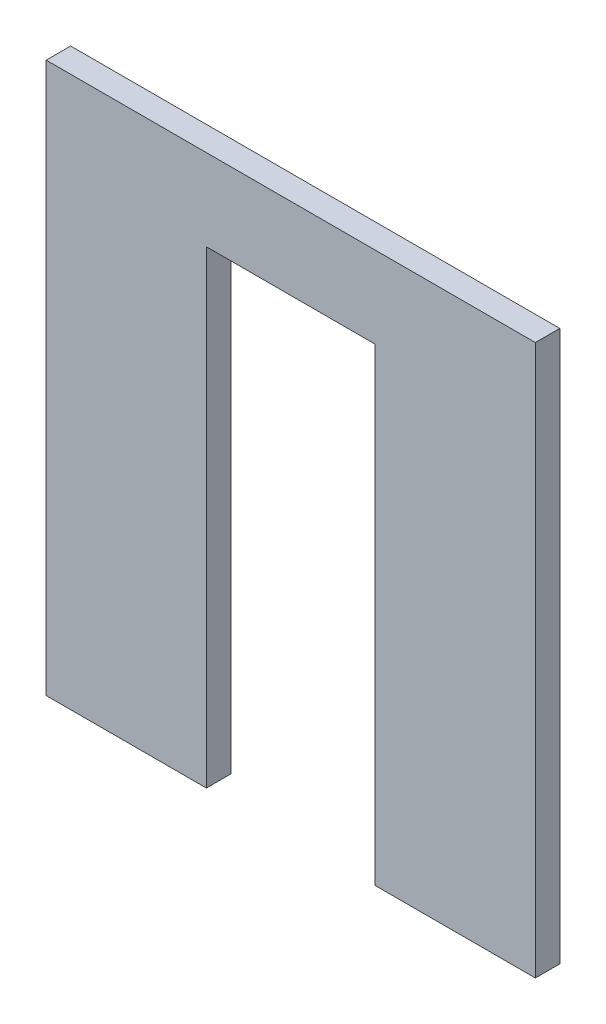
ISO-10303-21;
HEADER;
FILE_DESCRIPTION(('STEP AP214'),'2;1');
FILE_NAME('part.step','',(''),(''),'','','');
FILE_SCHEMA(('AUTOMOTIVE_DESIGN { 1 0 10303 214 1 1 1 1 }'));
ENDSEC;
DATA;
#1=APPLICATION_CONTEXT('core data for automotive mechanical design processes');
#2=APPLICATION_PROTOCOL_DEFINITION('international standard','automotive_design',2000,#1);
#3=PRODUCT_CONTEXT('',#1,'mechanical');
#4=PRODUCT('Part','Part','',(#3));
#5=PRODUCT_RELATED_PRODUCT_CATEGORY('part','',(#4));
#6=PRODUCT_DEFINITION_FORMATION('','',#4);
#7=PRODUCT_DEFINITION_CONTEXT('part definition',#1,'design');
#8=PRODUCT_DEFINITION('design','',#6,#7);
#9=PRODUCT_DEFINITION_SHAPE('','',#8);
#10=(LENGTH_UNIT() NAMED_UNIT(*) SI_UNIT(.MILLI.,.METRE.));
#11=(NAMED_UNIT(*) PLANE_ANGLE_UNIT() SI_UNIT($,.RADIAN.));
#12=(NAMED_UNIT(*) SI_UNIT($,.STERADIAN.) SOLID_ANGLE_UNIT());
#13=UNCERTAINTY_MEASURE_WITH_UNIT(LENGTH_MEASURE(1.E-05),#10,'distance_accuracy_value','');
#14=(GEOMETRIC_REPRESENTATION_CONTEXT(3) GLOBAL_UNCERTAINTY_ASSIGNED_CONTEXT((#13)) GLOBAL_UNIT_ASSIGNED_CONTEXT((#10,
#11,#12)) REPRESENTATION_CONTEXT('',''));
#15=CARTESIAN_POINT('',(0.,0.,0.));
#16=DIRECTION('',(0.,0.,1.));
#17=DIRECTION('',(1.,0.,0.));
#18=AXIS2_PLACEMENT_3D('',#15,#16,#17);
#19=CARTESIAN_POINT('',(0.,0.,0.003));
#20=DIRECTION('',(0.,1.,0.));
#21=DIRECTION('',(0.,0.,1.));
#22=AXIS2_PLACEMENT_3D('',#19,#20,#21);
#23=PLANE('',#22);
#24=DIRECTION('',(1.,0.,0.));
#25=VECTOR('',#24,1.);
#26=CARTESIAN_POINT('',(0.,0.,0.));
#27=LINE('',#26,#25);
#28=CARTESIAN_POINT('',(0.,0.,0.));
#29=VERTEX_POINT('',#28);
#30=CARTESIAN_POINT('',(0.01965,0.,0.));
#31=VERTEX_POINT('',#30);
#32=EDGE_CURVE('E135',#29,#31,#27,.T.);
#33=ORIENTED_EDGE('',*,*,#32,.T.);
#34=DIRECTION('',(0.,0.,-1.));
#35=VECTOR('',#34,1.);
#36=CARTESIAN_POINT('',(0.01965,0.,0.003));
#37=LINE('',#36,#35);
#38=CARTESIAN_POINT('',(0.01965,0.,0.003));
#39=VERTEX_POINT('',#38);
#40=EDGE_CURVE('E43',#39,#31,#37,.T.);
#41=ORIENTED_EDGE('',*,*,#40,.F.);
#42=DIRECTION('',(1.,0.,0.));
#43=VECTOR('',#42,1.);
#44=CARTESIAN_POINT('',(0.,0.,0.003));
#45=LINE('',#44,#43);
#46=CARTESIAN_POINT('',(0.,0.,0.003));
#47=VERTEX_POINT('',#46);
#48=EDGE_CURVE('E94',#47,#39,#45,.T.);
#49=ORIENTED_EDGE('',*,*,#48,.F.);
#50=DIRECTION('',(0.,0.,-1.));
#51=VECTOR('',#50,1.);
#52=CARTESIAN_POINT('',(0.,0.,0.003));
#53=LINE('',#52,#51);
#54=EDGE_CURVE('E11',#47,#29,#53,.T.);
#55=ORIENTED_EDGE('',*,*,#54,.T.);
#56=EDGE_LOOP('',(#33,#41,#49,#55));
#57=FACE_BOUND('',#56,.T.);
#58=ADVANCED_FACE('F35',(#57),#23,.F.);
#59=CARTESIAN_POINT('',(0.01965,0.,0.003));
#60=DIRECTION('',(-1.,0.,0.));
#61=DIRECTION('',(0.,0.,1.));
#62=AXIS2_PLACEMENT_3D('',#59,#60,#61);
#63=PLANE('',#62);
#64=DIRECTION('',(0.,1.,0.));
#65=VECTOR('',#64,1.);
#66=CARTESIAN_POINT('',(0.01965,0.,0.));
#67=LINE('',#66,#65);
#68=CARTESIAN_POINT('',(0.01965,0.0575,0.));
#69=VERTEX_POINT('',#68);
#70=EDGE_CURVE('E137',#31,#69,#67,.T.);
#71=ORIENTED_EDGE('',*,*,#70,.T.);
#72=DIRECTION('',(0.,0.,-1.));
#73=VECTOR('',#72,1.);
#74=CARTESIAN_POINT('',(0.01965,0.0575,0.003));
#75=LINE('',#74,#73);
#76=CARTESIAN_POINT('',(0.01965,0.0575,0.003));
#77=VERTEX_POINT('',#76);
#78=EDGE_CURVE('E154',#77,#69,#75,.T.);
#79=ORIENTED_EDGE('',*,*,#78,.F.);
#80=DIRECTION('',(0.,1.,0.));
#81=VECTOR('',#80,1.);
#82=CARTESIAN_POINT('',(0.01965,0.,0.003));
#83=LINE('',#82,#81);
#84=EDGE_CURVE('E162',#39,#77,#83,.T.);
#85=ORIENTED_EDGE('',*,*,#84,.F.);
#86=ORIENTED_EDGE('',*,*,#40,.T.);
#87=EDGE_LOOP('',(#71,#79,#85,#86));
#88=FACE_BOUND('',#87,.T.);
#89=ADVANCED_FACE('F160',(#88),#63,.F.);
#90=CARTESIAN_POINT('',(0.01965,0.0575,0.003));
#91=DIRECTION('',(0.,1.,0.));
#92=DIRECTION('',(0.,0.,1.));
#93=AXIS2_PLACEMENT_3D('',#90,#91,#92);
#94=PLANE('',#93);
#95=DIRECTION('',(1.,0.,0.));
#96=VECTOR('',#95,1.);
#97=CARTESIAN_POINT('',(0.01965,0.0575,0.));
#98=LINE('',#97,#96);
#99=CARTESIAN_POINT('',(0.04035,0.0575,0.));
#100=VERTEX_POINT('',#99);
#101=EDGE_CURVE('E139',#69,#100,#98,.T.);
#102=ORIENTED_EDGE('',*,*,#101,.T.);
#103=DIRECTION('',(0.,0.,-1.));
#104=VECTOR('',#103,1.);
#105=CARTESIAN_POINT('',(0.04035,0.0575,0.003));
#106=LINE('',#105,#104);
#107=CARTESIAN_POINT('',(0.04035,0.0575,0.003));
#108=VERTEX_POINT('',#107);
#109=EDGE_CURVE('E151',#108,#100,#106,.T.);
#110=ORIENTED_EDGE('',*,*,#109,.F.);
#111=DIRECTION('',(1.,0.,0.));
#112=VECTOR('',#111,1.);
#113=CARTESIAN_POINT('',(0.01965,0.0575,0.003));
#114=LINE('',#113,#112);
#115=EDGE_CURVE('E175',#77,#108,#114,.T.);
#116=ORIENTED_EDGE('',*,*,#115,.F.);
#117=ORIENTED_EDGE('',*,*,#78,.T.);
#118=EDGE_LOOP('',(#102,#110,#116,#117));
#119=FACE_BOUND('',#118,.T.);
#120=ADVANCED_FACE('F171',(#119),#94,.F.);
#121=CARTESIAN_POINT('',(0.04035,0.0575,0.003));
#122=DIRECTION('',(1.,0.,0.));
#123=DIRECTION('',(0.,1.,0.));
#124=AXIS2_PLACEMENT_3D('',#121,#122,#123);
#125=PLANE('',#124);
#126=DIRECTION('',(0.,-1.,0.));
#127=VECTOR('',#126,1.);
#128=CARTESIAN_POINT('',(0.04035,0.0575,0.));
#129=LINE('',#128,#127);
#130=CARTESIAN_POINT('',(0.04035,0.,0.));
#131=VERTEX_POINT('',#130);
#132=EDGE_CURVE('E141',#100,#131,#129,.T.);
#133=ORIENTED_EDGE('',*,*,#132,.T.);
#134=DIRECTION('',(0.,0.,-1.));
#135=VECTOR('',#134,1.);
#136=CARTESIAN_POINT('',(0.04035,0.,0.003));
#137=LINE('',#136,#135);
#138=CARTESIAN_POINT('',(0.04035,0.,0.003));
#139=VERTEX_POINT('',#138);
#140=EDGE_CURVE('E124',#139,#131,#137,.T.);
#141=ORIENTED_EDGE('',*,*,#140,.F.);
#142=DIRECTION('',(0.,-1.,0.));
#143=VECTOR('',#142,1.);
#144=CARTESIAN_POINT('',(0.04035,0.0575,0.003));
#145=LINE('',#144,#143);
#146=EDGE_CURVE('E114',#108,#139,#145,.T.);
#147=ORIENTED_EDGE('',*,*,#146,.F.);
#148=ORIENTED_EDGE('',*,*,#109,.T.);
#149=EDGE_LOOP('',(#133,#141,#147,#148));
#150=FACE_BOUND('',#149,.T.);
#151=ADVANCED_FACE('F174',(#150),#125,.F.);
#152=CARTESIAN_POINT('',(0.06,0.,0.003));
#153=DIRECTION('',(0.,1.,0.));
#154=DIRECTION('',(-1.,0.,0.));
#155=AXIS2_PLACEMENT_3D('',#152,#153,#154);
#156=PLANE('',#155);
#157=DIRECTION('',(1.,0.,0.));
#158=VECTOR('',#157,1.);
#159=CARTESIAN_POINT('',(0.06,0.,0.));
#160=LINE('',#159,#158);
#161=CARTESIAN_POINT('',(0.06,0.,0.));
#162=VERTEX_POINT('',#161);
#163=EDGE_CURVE('E123',#131,#162,#160,.T.);
#164=ORIENTED_EDGE('',*,*,#163,.T.);
#165=DIRECTION('',(0.,0.,-1.));
#166=VECTOR('',#165,1.);
#167=CARTESIAN_POINT('',(0.06,0.,0.003));
#168=LINE('',#167,#166);
#169=CARTESIAN_POINT('',(0.06,0.,0.003));
#170=VERTEX_POINT('',#169);
#171=EDGE_CURVE('E120',#170,#162,#168,.T.);
#172=ORIENTED_EDGE('',*,*,#171,.F.);
#173=DIRECTION('',(1.,0.,0.));
#174=VECTOR('',#173,1.);
#175=CARTESIAN_POINT('',(0.06,0.,0.003));
#176=LINE('',#175,#174);
#177=EDGE_CURVE('E108',#139,#170,#176,.T.);
#178=ORIENTED_EDGE('',*,*,#177,.F.);
#179=ORIENTED_EDGE('',*,*,#140,.T.);
#180=EDGE_LOOP('',(#164,#172,#178,#179));
#181=FACE_BOUND('',#180,.T.);
#182=ADVANCED_FACE('F121',(#181),#156,.F.);
#183=CARTESIAN_POINT('',(0.06,0.055,0.003));
#184=DIRECTION('',(-1.,0.,0.));
#185=DIRECTION('',(0.,0.,1.));
#186=AXIS2_PLACEMENT_3D('',#183,#184,#185);
#187=PLANE('',#186);
#188=DIRECTION('',(0.,1.,0.));
#189=VECTOR('',#188,1.);
#190=CARTESIAN_POINT('',(0.06,0.055,0.));
#191=LINE('',#190,#189);
#192=CARTESIAN_POINT('',(0.06,0.0675,0.));
#193=VERTEX_POINT('',#192);
#194=EDGE_CURVE('E80',#162,#193,#191,.T.);
#195=ORIENTED_EDGE('',*,*,#194,.T.);
#196=DIRECTION('',(0.,0.,-1.));
#197=VECTOR('',#196,1.);
#198=CARTESIAN_POINT('',(0.06,0.0675,0.003));
#199=LINE('',#198,#197);
#200=CARTESIAN_POINT('',(0.06,0.0675,0.003));
#201=VERTEX_POINT('',#200);
#202=EDGE_CURVE('E125',#201,#193,#199,.T.);
#203=ORIENTED_EDGE('',*,*,#202,.F.);
#204=DIRECTION('',(0.,1.,0.));
#205=VECTOR('',#204,1.);
#206=CARTESIAN_POINT('',(0.06,0.055,0.003));
#207=LINE('',#206,#205);
#208=EDGE_CURVE('E112',#170,#201,#207,.T.);
#209=ORIENTED_EDGE('',*,*,#208,.F.);
#210=ORIENTED_EDGE('',*,*,#171,.T.);
#211=EDGE_LOOP('',(#195,#203,#209,#210));
#212=FACE_BOUND('',#211,.T.);
#213=ADVANCED_FACE('F127',(#212),#187,.F.);
#214=CARTESIAN_POINT('',(0.,0.0675,0.003));
#215=DIRECTION('',(0.,-1.,0.));
#216=DIRECTION('',(0.,0.,-1.));
#217=AXIS2_PLACEMENT_3D('',#214,#215,#216);
#218=PLANE('',#217);
#219=DIRECTION('',(-1.,0.,0.));
#220=VECTOR('',#219,1.);
#221=CARTESIAN_POINT('',(0.,0.0675,0.));
#222=LINE('',#221,#220);
#223=CARTESIAN_POINT('',(0.,0.0675,0.));
#224=VERTEX_POINT('',#223);
#225=EDGE_CURVE('E87',#193,#224,#222,.T.);
#226=ORIENTED_EDGE('',*,*,#225,.T.);
#227=DIRECTION('',(0.,0.,-1.));
#228=VECTOR('',#227,1.);
#229=CARTESIAN_POINT('',(0.,0.0675,0.003));
#230=LINE('',#229,#228);
#231=CARTESIAN_POINT('',(0.,0.0675,0.003));
#232=VERTEX_POINT('',#231);
#233=EDGE_CURVE('E131',#232,#224,#230,.T.);
#234=ORIENTED_EDGE('',*,*,#233,.F.);
#235=DIRECTION('',(-1.,0.,0.));
#236=VECTOR('',#235,1.);
#237=CARTESIAN_POINT('',(0.,0.0675,0.003));
#238=LINE('',#237,#236);
#239=EDGE_CURVE('E129',#201,#232,#238,.T.);
#240=ORIENTED_EDGE('',*,*,#239,.F.);
#241=ORIENTED_EDGE('',*,*,#202,.T.);
#242=EDGE_LOOP('',(#226,#234,#240,#241));
#243=FACE_BOUND('',#242,.T.);
#244=ADVANCED_FACE('F196',(#243),#218,.F.);
#245=CARTESIAN_POINT('',(0.,0.055,0.003));
#246=DIRECTION('',(1.,0.,0.));
#247=DIRECTION('',(0.,0.,-1.));
#248=AXIS2_PLACEMENT_3D('',#245,#246,#247);
#249=PLANE('',#248);
#250=DIRECTION('',(0.,-1.,0.));
#251=VECTOR('',#250,1.);
#252=CARTESIAN_POINT('',(0.,0.055,0.));
#253=LINE('',#252,#251);
#254=EDGE_CURVE('E146',#224,#29,#253,.T.);
#255=ORIENTED_EDGE('',*,*,#254,.T.);
#256=ORIENTED_EDGE('',*,*,#54,.F.);
#257=DIRECTION('',(0.,-1.,0.));
#258=VECTOR('',#257,1.);
#259=CARTESIAN_POINT('',(0.,0.,0.003));
#260=LINE('',#259,#258);
#261=EDGE_CURVE('E51',#232,#47,#260,.T.);
#262=ORIENTED_EDGE('',*,*,#261,.F.);
#263=ORIENTED_EDGE('',*,*,#233,.T.);
#264=EDGE_LOOP('',(#255,#256,#262,#263));
#265=FACE_BOUND('',#264,.T.);
#266=ADVANCED_FACE('F180',(#265),#249,.F.);
#267=CARTESIAN_POINT('',(0.,0.,0.003));
#268=DIRECTION('',(0.,0.,-1.));
#269=DIRECTION('',(-1.,0.,0.));
#270=AXIS2_PLACEMENT_3D('',#267,#268,#269);
#271=PLANE('',#270);
#272=ORIENTED_EDGE('',*,*,#261,.T.);
#273=ORIENTED_EDGE('',*,*,#48,.T.);
#274=ORIENTED_EDGE('',*,*,#84,.T.);
#275=ORIENTED_EDGE('',*,*,#115,.T.);
#276=ORIENTED_EDGE('',*,*,#146,.T.);
#277=ORIENTED_EDGE('',*,*,#177,.T.);
#278=ORIENTED_EDGE('',*,*,#208,.T.);
#279=ORIENTED_EDGE('',*,*,#239,.T.);
#280=EDGE_LOOP('',(#272,#273,#274,#275,#276,#277,#278,#279));
#281=FACE_BOUND('',#280,.T.);
#282=ADVANCED_FACE('F110',(#281),#271,.F.);
#283=CARTESIAN_POINT('',(0.,0.,0.));
#284=DIRECTION('',(0.,0.,-1.));
#285=DIRECTION('',(-1.,0.,0.));
#286=AXIS2_PLACEMENT_3D('',#283,#284,#285);
#287=PLANE('',#286);
#288=ORIENTED_EDGE('',*,*,#32,.F.);
#289=ORIENTED_EDGE('',*,*,#254,.F.);
#290=ORIENTED_EDGE('',*,*,#225,.F.);
#291=ORIENTED_EDGE('',*,*,#194,.F.);
#292=ORIENTED_EDGE('',*,*,#163,.F.);
#293=ORIENTED_EDGE('',*,*,#132,.F.);
#294=ORIENTED_EDGE('',*,*,#101,.F.);
#295=ORIENTED_EDGE('',*,*,#70,.F.);
#296=EDGE_LOOP('',(#288,#289,#290,#291,#292,#293,#294,#295));
#297=FACE_BOUND('',#296,.T.);
#298=ADVANCED_FACE('F166',(#297),#287,.T.);
#299=CLOSED_SHELL('',(#58,#89,#120,#151,#182,#213,#244,#266,#282,#298));
#300=MANIFOLD_SOLID_BREP('B2',#299);
#301=ADVANCED_BREP_SHAPE_REPRESENTATION('',(#18,#300),#14);
#302=SHAPE_DEFINITION_REPRESENTATION(#9,#301);
ENDSEC;
END-ISO-10303-21;
